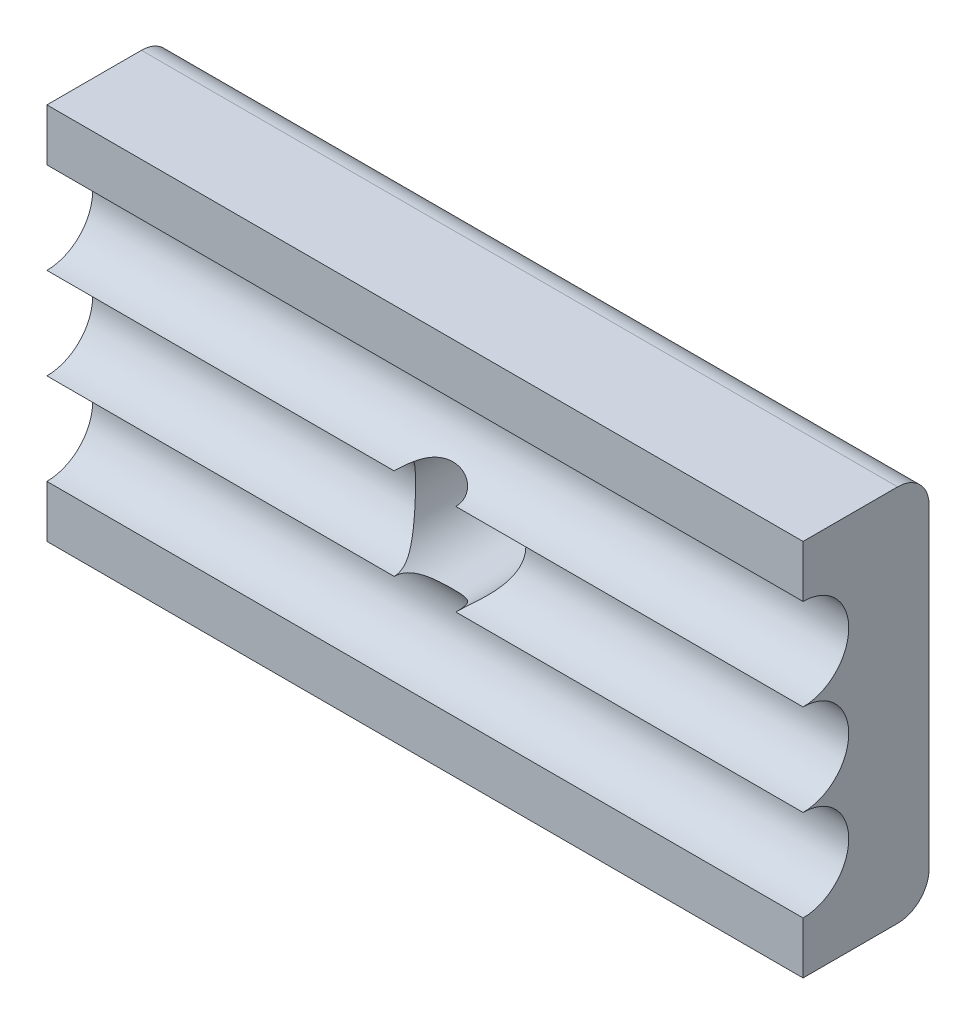
ISO-10303-21;
HEADER;
FILE_DESCRIPTION(('STEP AP214'),'2;1');
FILE_NAME('part.step','',(''),(''),'','','');
FILE_SCHEMA(('AUTOMOTIVE_DESIGN { 1 0 10303 214 1 1 1 1 }'));
ENDSEC;
DATA;
#1=APPLICATION_CONTEXT('core data for automotive mechanical design processes');
#2=APPLICATION_PROTOCOL_DEFINITION('international standard','automotive_design',2000,#1);
#3=PRODUCT_CONTEXT('',#1,'mechanical');
#4=PRODUCT('Part','Part','',(#3));
#5=PRODUCT_RELATED_PRODUCT_CATEGORY('part','',(#4));
#6=PRODUCT_DEFINITION_FORMATION('','',#4);
#7=PRODUCT_DEFINITION_CONTEXT('part definition',#1,'design');
#8=PRODUCT_DEFINITION('design','',#6,#7);
#9=PRODUCT_DEFINITION_SHAPE('','',#8);
#10=(LENGTH_UNIT() NAMED_UNIT(*) SI_UNIT(.MILLI.,.METRE.));
#11=(NAMED_UNIT(*) PLANE_ANGLE_UNIT() SI_UNIT($,.RADIAN.));
#12=(NAMED_UNIT(*) SI_UNIT($,.STERADIAN.) SOLID_ANGLE_UNIT());
#13=UNCERTAINTY_MEASURE_WITH_UNIT(LENGTH_MEASURE(1.E-05),#10,'distance_accuracy_value','');
#14=(GEOMETRIC_REPRESENTATION_CONTEXT(3) GLOBAL_UNCERTAINTY_ASSIGNED_CONTEXT((#13)) GLOBAL_UNIT_ASSIGNED_CONTEXT((#10,
#11,#12)) REPRESENTATION_CONTEXT('',''));
#15=CARTESIAN_POINT('',(0.,0.,0.));
#16=DIRECTION('',(0.,0.,1.));
#17=DIRECTION('',(1.,0.,0.));
#18=AXIS2_PLACEMENT_3D('',#15,#16,#17);
#19=CARTESIAN_POINT('',(0.,0.,4.));
#20=DIRECTION('',(0.,0.,1.));
#21=DIRECTION('',(1.,0.,0.));
#22=AXIS2_PLACEMENT_3D('',#19,#20,#21);
#23=PLANE('',#22);
#24=DIRECTION('',(-1.,0.,0.));
#25=VECTOR('',#24,1.);
#26=CARTESIAN_POINT('',(26.957345971564,2.35,4.));
#27=LINE('',#26,#25);
#28=CARTESIAN_POINT('',(18.957345971564,2.35,4.));
#29=VERTEX_POINT('',#28);
#30=CARTESIAN_POINT('',(-5.04265402843602,2.35,4.));
#31=VERTEX_POINT('',#30);
#32=EDGE_CURVE('E152',#29,#31,#27,.T.);
#33=ORIENTED_EDGE('',*,*,#32,.F.);
#34=DIRECTION('',(0.,1.,0.));
#35=VECTOR('',#34,1.);
#36=CARTESIAN_POINT('',(18.957345971564,4.,4.));
#37=LINE('',#36,#35);
#38=CARTESIAN_POINT('',(18.957345971564,4.,4.));
#39=VERTEX_POINT('',#38);
#40=EDGE_CURVE('E188',#29,#39,#37,.T.);
#41=ORIENTED_EDGE('',*,*,#40,.T.);
#42=DIRECTION('',(-1.,0.,0.));
#43=VECTOR('',#42,1.);
#44=CARTESIAN_POINT('',(-5.04265402843602,4.,4.));
#45=LINE('',#44,#43);
#46=CARTESIAN_POINT('',(-5.04265402843602,4.,4.));
#47=VERTEX_POINT('',#46);
#48=EDGE_CURVE('E192',#39,#47,#45,.T.);
#49=ORIENTED_EDGE('',*,*,#48,.T.);
#50=DIRECTION('',(0.,-1.,0.));
#51=VECTOR('',#50,1.);
#52=CARTESIAN_POINT('',(-5.04265402843602,4.,4.));
#53=LINE('',#52,#51);
#54=EDGE_CURVE('E183',#47,#31,#53,.T.);
#55=ORIENTED_EDGE('',*,*,#54,.T.);
#56=EDGE_LOOP('',(#33,#41,#49,#55));
#57=FACE_BOUND('',#56,.T.);
#58=ADVANCED_FACE('F45',(#57),#23,.T.);
#59=CARTESIAN_POINT('',(-5.04265402843602,4.,4.));
#60=DIRECTION('',(1.,0.,0.));
#61=DIRECTION('',(0.,1.,0.));
#62=AXIS2_PLACEMENT_3D('',#59,#60,#61);
#63=PLANE('',#62);
#64=CARTESIAN_POINT('',(-5.04265402843602,-4.9,4.));
#65=DIRECTION('',(-1.,0.,0.));
#66=DIRECTION('',(0.,0.,1.));
#67=AXIS2_PLACEMENT_3D('',#64,#65,#66);
#68=CIRCLE('',#67,1.45);
#69=CARTESIAN_POINT('',(-5.04265402843602,-3.45,4.));
#70=VERTEX_POINT('',#69);
#71=CARTESIAN_POINT('',(-5.04265402843602,-6.35,4.));
#72=VERTEX_POINT('',#71);
#73=EDGE_CURVE('E162',#70,#72,#68,.T.);
#74=ORIENTED_EDGE('',*,*,#73,.F.);
#75=CARTESIAN_POINT('',(-5.04265402843602,-2.,4.));
#76=DIRECTION('',(-1.,0.,0.));
#77=DIRECTION('',(0.,0.,1.));
#78=AXIS2_PLACEMENT_3D('',#75,#76,#77);
#79=CIRCLE('',#78,1.45);
#80=CARTESIAN_POINT('',(-5.04265402843602,-0.55,4.));
#81=VERTEX_POINT('',#80);
#82=EDGE_CURVE('E143',#81,#70,#79,.T.);
#83=ORIENTED_EDGE('',*,*,#82,.F.);
#84=CARTESIAN_POINT('',(-5.04265402843602,0.9,4.));
#85=DIRECTION('',(-1.,0.,0.));
#86=DIRECTION('',(0.,0.,1.));
#87=AXIS2_PLACEMENT_3D('',#84,#85,#86);
#88=CIRCLE('',#87,1.45);
#89=EDGE_CURVE('E159',#31,#81,#88,.T.);
#90=ORIENTED_EDGE('',*,*,#89,.F.);
#91=ORIENTED_EDGE('',*,*,#54,.F.);
#92=DIRECTION('',(0.,0.,-1.));
#93=VECTOR('',#92,1.);
#94=CARTESIAN_POINT('',(-5.04265402843602,4.,4.));
#95=LINE('',#94,#93);
#96=CARTESIAN_POINT('',(-5.04265402843602,4.,1.));
#97=VERTEX_POINT('',#96);
#98=EDGE_CURVE('E194',#47,#97,#95,.T.);
#99=ORIENTED_EDGE('',*,*,#98,.T.);
#100=CARTESIAN_POINT('',(-5.04265402843602,3.,1.));
#101=DIRECTION('',(1.,0.,0.));
#102=DIRECTION('',(0.,1.,0.));
#103=AXIS2_PLACEMENT_3D('',#100,#101,#102);
#104=CIRCLE('',#103,1.);
#105=CARTESIAN_POINT('',(-5.04265402843602,3.,0.));
#106=VERTEX_POINT('',#105);
#107=EDGE_CURVE('E74',#97,#106,#104,.F.);
#108=ORIENTED_EDGE('',*,*,#107,.T.);
#109=DIRECTION('',(0.,-1.,0.));
#110=VECTOR('',#109,1.);
#111=CARTESIAN_POINT('',(-5.04265402843602,4.,0.));
#112=LINE('',#111,#110);
#113=CARTESIAN_POINT('',(-5.04265402843602,-7.,0.));
#114=VERTEX_POINT('',#113);
#115=EDGE_CURVE('E195',#106,#114,#112,.T.);
#116=ORIENTED_EDGE('',*,*,#115,.T.);
#117=CARTESIAN_POINT('',(-5.04265402843602,-7.,1.));
#118=DIRECTION('',(1.,0.,0.));
#119=DIRECTION('',(0.,1.,0.));
#120=AXIS2_PLACEMENT_3D('',#117,#118,#119);
#121=CIRCLE('',#120,1.);
#122=CARTESIAN_POINT('',(-5.04265402843602,-8.,1.));
#123=VERTEX_POINT('',#122);
#124=EDGE_CURVE('E226',#114,#123,#121,.F.);
#125=ORIENTED_EDGE('',*,*,#124,.T.);
#126=DIRECTION('',(0.,0.,-1.));
#127=VECTOR('',#126,1.);
#128=CARTESIAN_POINT('',(-5.04265402843602,-8.,4.));
#129=LINE('',#128,#127);
#130=CARTESIAN_POINT('',(-5.04265402843602,-8.,4.));
#131=VERTEX_POINT('',#130);
#132=EDGE_CURVE('E209',#131,#123,#129,.T.);
#133=ORIENTED_EDGE('',*,*,#132,.F.);
#134=EDGE_CURVE('E186',#72,#131,#53,.T.);
#135=ORIENTED_EDGE('',*,*,#134,.F.);
#136=EDGE_LOOP('',(#74,#83,#90,#91,#99,#108,#116,#125,#133,#135));
#137=FACE_BOUND('',#136,.T.);
#138=ADVANCED_FACE('F157',(#137),#63,.F.);
#139=CARTESIAN_POINT('',(-5.04265402843602,-8.,4.));
#140=DIRECTION('',(0.,1.,0.));
#141=DIRECTION('',(0.,0.,1.));
#142=AXIS2_PLACEMENT_3D('',#139,#140,#141);
#143=PLANE('',#142);
#144=ORIENTED_EDGE('',*,*,#132,.T.);
#145=DIRECTION('',(1.,0.,0.));
#146=VECTOR('',#145,1.);
#147=CARTESIAN_POINT('',(-5.04265402843602,-8.,1.));
#148=LINE('',#147,#146);
#149=CARTESIAN_POINT('',(18.957345971564,-8.,1.));
#150=VERTEX_POINT('',#149);
#151=EDGE_CURVE('E212',#123,#150,#148,.T.);
#152=ORIENTED_EDGE('',*,*,#151,.T.);
#153=DIRECTION('',(0.,0.,-1.));
#154=VECTOR('',#153,1.);
#155=CARTESIAN_POINT('',(18.957345971564,-8.,4.));
#156=LINE('',#155,#154);
#157=CARTESIAN_POINT('',(18.957345971564,-8.,4.));
#158=VERTEX_POINT('',#157);
#159=EDGE_CURVE('E206',#158,#150,#156,.T.);
#160=ORIENTED_EDGE('',*,*,#159,.F.);
#161=DIRECTION('',(1.,0.,0.));
#162=VECTOR('',#161,1.);
#163=CARTESIAN_POINT('',(-5.04265402843602,-8.,4.));
#164=LINE('',#163,#162);
#165=EDGE_CURVE('E185',#131,#158,#164,.T.);
#166=ORIENTED_EDGE('',*,*,#165,.F.);
#167=EDGE_LOOP('',(#144,#152,#160,#166));
#168=FACE_BOUND('',#167,.T.);
#169=ADVANCED_FACE('F289',(#168),#143,.F.);
#170=CARTESIAN_POINT('',(18.957345971564,4.,4.));
#171=DIRECTION('',(-1.,0.,0.));
#172=DIRECTION('',(0.,0.,1.));
#173=AXIS2_PLACEMENT_3D('',#170,#171,#172);
#174=PLANE('',#173);
#175=CARTESIAN_POINT('',(18.957345971564,0.9,4.));
#176=DIRECTION('',(-1.,0.,0.));
#177=DIRECTION('',(0.,0.,1.));
#178=AXIS2_PLACEMENT_3D('',#175,#176,#177);
#179=CIRCLE('',#178,1.45);
#180=CARTESIAN_POINT('',(18.957345971564,-0.55,4.));
#181=VERTEX_POINT('',#180);
#182=EDGE_CURVE('E175',#29,#181,#179,.T.);
#183=ORIENTED_EDGE('',*,*,#182,.T.);
#184=CARTESIAN_POINT('',(18.957345971564,-2.,4.));
#185=DIRECTION('',(-1.,0.,0.));
#186=DIRECTION('',(0.,0.,1.));
#187=AXIS2_PLACEMENT_3D('',#184,#185,#186);
#188=CIRCLE('',#187,1.45);
#189=CARTESIAN_POINT('',(18.957345971564,-3.45,4.));
#190=VERTEX_POINT('',#189);
#191=EDGE_CURVE('E166',#181,#190,#188,.T.);
#192=ORIENTED_EDGE('',*,*,#191,.T.);
#193=CARTESIAN_POINT('',(18.957345971564,-4.9,4.));
#194=DIRECTION('',(-1.,0.,0.));
#195=DIRECTION('',(0.,0.,1.));
#196=AXIS2_PLACEMENT_3D('',#193,#194,#195);
#197=CIRCLE('',#196,1.45);
#198=CARTESIAN_POINT('',(18.957345971564,-6.35,4.));
#199=VERTEX_POINT('',#198);
#200=EDGE_CURVE('E178',#190,#199,#197,.T.);
#201=ORIENTED_EDGE('',*,*,#200,.T.);
#202=EDGE_CURVE('E189',#158,#199,#37,.T.);
#203=ORIENTED_EDGE('',*,*,#202,.F.);
#204=ORIENTED_EDGE('',*,*,#159,.T.);
#205=CARTESIAN_POINT('',(18.957345971564,-7.,1.));
#206=DIRECTION('',(-1.,0.,0.));
#207=DIRECTION('',(0.,0.,1.));
#208=AXIS2_PLACEMENT_3D('',#205,#206,#207);
#209=CIRCLE('',#208,1.);
#210=CARTESIAN_POINT('',(18.957345971564,-7.,0.));
#211=VERTEX_POINT('',#210);
#212=EDGE_CURVE('E219',#150,#211,#209,.F.);
#213=ORIENTED_EDGE('',*,*,#212,.T.);
#214=DIRECTION('',(0.,1.,0.));
#215=VECTOR('',#214,1.);
#216=CARTESIAN_POINT('',(18.957345971564,4.,0.));
#217=LINE('',#216,#215);
#218=CARTESIAN_POINT('',(18.957345971564,3.,0.));
#219=VERTEX_POINT('',#218);
#220=EDGE_CURVE('E198',#211,#219,#217,.T.);
#221=ORIENTED_EDGE('',*,*,#220,.T.);
#222=CARTESIAN_POINT('',(18.957345971564,3.,1.));
#223=DIRECTION('',(-1.,0.,0.));
#224=DIRECTION('',(0.,0.,1.));
#225=AXIS2_PLACEMENT_3D('',#222,#223,#224);
#226=CIRCLE('',#225,1.);
#227=CARTESIAN_POINT('',(18.957345971564,4.,1.));
#228=VERTEX_POINT('',#227);
#229=EDGE_CURVE('E217',#219,#228,#226,.F.);
#230=ORIENTED_EDGE('',*,*,#229,.T.);
#231=DIRECTION('',(0.,0.,-1.));
#232=VECTOR('',#231,1.);
#233=CARTESIAN_POINT('',(18.957345971564,4.,4.));
#234=LINE('',#233,#232);
#235=EDGE_CURVE('E203',#39,#228,#234,.T.);
#236=ORIENTED_EDGE('',*,*,#235,.F.);
#237=ORIENTED_EDGE('',*,*,#40,.F.);
#238=EDGE_LOOP('',(#183,#192,#201,#203,#204,#213,#221,#230,#236,#237));
#239=FACE_BOUND('',#238,.T.);
#240=ADVANCED_FACE('F269',(#239),#174,.F.);
#241=CARTESIAN_POINT('',(-5.04265402843602,4.,4.));
#242=DIRECTION('',(0.,-1.,0.));
#243=DIRECTION('',(0.,0.,-1.));
#244=AXIS2_PLACEMENT_3D('',#241,#242,#243);
#245=PLANE('',#244);
#246=ORIENTED_EDGE('',*,*,#235,.T.);
#247=DIRECTION('',(-1.,0.,0.));
#248=VECTOR('',#247,1.);
#249=CARTESIAN_POINT('',(-5.04265402843602,4.,1.));
#250=LINE('',#249,#248);
#251=EDGE_CURVE('E228',#228,#97,#250,.T.);
#252=ORIENTED_EDGE('',*,*,#251,.T.);
#253=ORIENTED_EDGE('',*,*,#98,.F.);
#254=ORIENTED_EDGE('',*,*,#48,.F.);
#255=EDGE_LOOP('',(#246,#252,#253,#254));
#256=FACE_BOUND('',#255,.T.);
#257=ADVANCED_FACE('F276',(#256),#245,.F.);
#258=DIRECTION('',(-1.,0.,0.));
#259=VECTOR('',#258,1.);
#260=CARTESIAN_POINT('',(26.957345971564,-6.35,4.));
#261=LINE('',#260,#259);
#262=EDGE_CURVE('E179',#199,#72,#261,.T.);
#263=ORIENTED_EDGE('',*,*,#262,.T.);
#264=ORIENTED_EDGE('',*,*,#134,.T.);
#265=ORIENTED_EDGE('',*,*,#165,.T.);
#266=ORIENTED_EDGE('',*,*,#202,.T.);
#267=EDGE_LOOP('',(#263,#264,#265,#266));
#268=FACE_BOUND('',#267,.T.);
#269=ADVANCED_FACE('F292',(#268),#23,.T.);
#270=CARTESIAN_POINT('',(0.,0.,0.));
#271=DIRECTION('',(0.,0.,1.));
#272=DIRECTION('',(1.,0.,0.));
#273=AXIS2_PLACEMENT_3D('',#270,#271,#272);
#274=PLANE('',#273);
#275=CARTESIAN_POINT('',(6.95734597156398,-2.,0.));
#276=DIRECTION('',(0.,0.,1.));
#277=DIRECTION('',(1.,0.,0.));
#278=AXIS2_PLACEMENT_3D('',#275,#276,#277);
#279=CIRCLE('',#278,1.75);
#280=CARTESIAN_POINT('',(8.70734597156398,-2.,0.));
#281=VERTEX_POINT('',#280);
#282=EDGE_CURVE('E182',#281,#281,#279,.T.);
#283=ORIENTED_EDGE('',*,*,#282,.T.);
#284=EDGE_LOOP('',(#283));
#285=FACE_BOUND('',#284,.T.);
#286=ORIENTED_EDGE('',*,*,#220,.F.);
#287=DIRECTION('',(1.,0.,0.));
#288=VECTOR('',#287,1.);
#289=CARTESIAN_POINT('',(0.,-7.,0.));
#290=LINE('',#289,#288);
#291=EDGE_CURVE('E223',#211,#114,#290,.F.);
#292=ORIENTED_EDGE('',*,*,#291,.T.);
#293=ORIENTED_EDGE('',*,*,#115,.F.);
#294=DIRECTION('',(-1.,0.,0.));
#295=VECTOR('',#294,1.);
#296=CARTESIAN_POINT('',(0.,3.,0.));
#297=LINE('',#296,#295);
#298=EDGE_CURVE('E221',#106,#219,#297,.F.);
#299=ORIENTED_EDGE('',*,*,#298,.T.);
#300=EDGE_LOOP('',(#286,#292,#293,#299));
#301=FACE_BOUND('',#300,.T.);
#302=ADVANCED_FACE('F281',(#285,#301),#274,.F.);
#303=CARTESIAN_POINT('',(6.95734597156398,-2.,-1.));
#304=DIRECTION('',(0.,0.,1.));
#305=DIRECTION('',(1.,0.,0.));
#306=AXIS2_PLACEMENT_3D('',#303,#304,#305);
#307=CYLINDRICAL_SURFACE('',#306,1.75);
#308=CARTESIAN_POINT('',(5.97755007445071,-3.45,4.));
#309=CARTESIAN_POINT('',(5.97755194233283,-3.4499976677626,3.97633628601516));
#310=CARTESIAN_POINT('',(5.97840779616265,-3.45057997572129,3.95268466196154));
#311=CARTESIAN_POINT('',(5.98183220967503,-3.45288650876825,3.90556346460477));
#312=CARTESIAN_POINT('',(5.9844006503065,-3.45461065448121,3.88209387876188));
#313=CARTESIAN_POINT('',(5.99466429959437,-3.46144306360112,3.81231123516577));
#314=CARTESIAN_POINT('',(6.00491781873658,-3.46821158619935,3.76649956243252));
#315=CARTESIAN_POINT('',(6.03219586271997,-3.48554870649781,3.67769513381392));
#316=CARTESIAN_POINT('',(6.0492247376288,-3.49611974515662,3.63470420966722));
#317=CARTESIAN_POINT('',(6.08983583666907,-3.52002568309783,3.55279734500478));
#318=CARTESIAN_POINT('',(6.11341563001302,-3.53335955673556,3.5138799003417));
#319=CARTESIAN_POINT('',(6.1660822015259,-3.56117446275479,3.4418718611224));
#320=CARTESIAN_POINT('',(6.19503805784331,-3.57562423926489,3.40867294915179));
#321=CARTESIAN_POINT('',(6.2580934112533,-3.60460232196287,3.34762807762235));
#322=CARTESIAN_POINT('',(6.29219458348109,-3.61913065223443,3.31978386810744));
#323=CARTESIAN_POINT('',(6.36662290101983,-3.64779197463727,3.26829484259211));
#324=CARTESIAN_POINT('',(6.40718673302541,-3.66186131321143,3.24495776993625));
#325=CARTESIAN_POINT('',(6.49194694241746,-3.68756272790673,3.20433997789725));
#326=CARTESIAN_POINT('',(6.53614472662384,-3.69919385387318,3.18706161779475));
#327=CARTESIAN_POINT('',(6.63158574601928,-3.72017293560857,3.15686197808194));
#328=CARTESIAN_POINT('',(6.6830934435594,-3.72918125200536,3.14454073124165));
#329=CARTESIAN_POINT('',(6.78784347414491,-3.74257356116374,3.12650746232511));
#330=CARTESIAN_POINT('',(6.84108670146586,-3.7469551297694,3.12079890477481));
#331=CARTESIAN_POINT('',(6.95289364090652,-3.75096588019993,3.11555914363058));
#332=CARTESIAN_POINT('',(7.01150366001797,-3.75013021609981,3.11663227418696));
#333=CARTESIAN_POINT('',(7.12772435070585,-3.74266000882637,3.12644340857658));
#334=CARTESIAN_POINT('',(7.1853347164129,-3.73602372163551,3.13518371762943));
#335=CARTESIAN_POINT('',(7.29894486835073,-3.71731826910091,3.16093943847082));
#336=CARTESIAN_POINT('',(7.35489471271013,-3.70515027323467,3.17810585815966));
#337=CARTESIAN_POINT('',(7.46208520597385,-3.67654699508107,3.22132801950014));
#338=CARTESIAN_POINT('',(7.51332857643663,-3.66011420025312,3.2473785822155));
#339=CARTESIAN_POINT('',(7.60561878852903,-3.62618791749578,3.30647814086269));
#340=CARTESIAN_POINT('',(7.64713506789811,-3.6088571310306,3.33888461801672));
#341=CARTESIAN_POINT('',(7.72283575354644,-3.57424880202857,3.41136922314374));
#342=CARTESIAN_POINT('',(7.75702732923928,-3.55697122389341,3.45143977611704));
#343=CARTESIAN_POINT('',(7.81370724432938,-3.5264578080733,3.53353928284657));
#344=CARTESIAN_POINT('',(7.83706265046234,-3.51298685276081,3.57488458289477));
#345=CARTESIAN_POINT('',(7.87661083942584,-3.48928984904281,3.66173848049971));
#346=CARTESIAN_POINT('',(7.89280463760474,-3.47906334070882,3.70724648677735));
#347=CARTESIAN_POINT('',(7.91591548235988,-3.4641762550955,3.79377994523416));
#348=CARTESIAN_POINT('',(7.92387200353293,-3.4589039269173,3.83442764997567));
#349=CARTESIAN_POINT('',(7.93448629090479,-3.45179377332595,3.91671047383407));
#350=CARTESIAN_POINT('',(7.93714302893682,-3.44995661434569,3.95834578296282));
#351=CARTESIAN_POINT('',(7.93714186867727,-3.45,3.99999999999999));
#352=B_SPLINE_CURVE_WITH_KNOTS('',3,(#308,#309,#310,#311,#312,#313,#314,#315,#316,#317,#318,
#319,#320,#321,#322,#323,#324,#325,#326,#327,#328,#329,#330,#331,#332,#333,#334,#335,#336,#337,
#338,#339,#340,#341,#342,#343,#344,#345,#346,#347,#348,#349,#350,#351),.UNSPECIFIED.,.F.,.F.,(4,
2,2,2,2,2,2,2,2,2,2,2,2,2,2,2,2,2,2,2,2,4),(0.,0.0709445106135215,0.141884090007934,
0.283394167009063,0.424995246512599,0.566543853455673,0.705013990204751,0.843529305657935,
0.989520264844489,1.13556801037601,1.29606202387151,1.45664008555401,1.63171770008956,
1.80684797164021,1.98523819492668,2.16352460438936,2.328914974554,2.49414271353915,
2.64145182630179,2.78874004738017,2.91352000216208,3.03832416210995),.UNSPECIFIED.);
#353=CARTESIAN_POINT('',(5.97755007445071,-3.45,4.));
#354=VERTEX_POINT('',#353);
#355=CARTESIAN_POINT('',(7.93714186867725,-3.45,4.));
#356=VERTEX_POINT('',#355);
#357=EDGE_CURVE('E12',#354,#356,#352,.T.);
#358=ORIENTED_EDGE('',*,*,#357,.T.);
#359=CARTESIAN_POINT('',(7.93714186867725,-3.45,4.));
#360=CARTESIAN_POINT('',(7.93712694195492,-3.45000457422705,3.97384849977603));
#361=CARTESIAN_POINT('',(7.93818984872994,-3.44929222429545,3.94771467125591));
#362=CARTESIAN_POINT('',(7.94233757049675,-3.44647897993039,3.89573135695612));
#363=CARTESIAN_POINT('',(7.94541856181722,-3.44438071133856,3.86988142726166));
#364=CARTESIAN_POINT('',(7.95737435292124,-3.43615370707763,3.79375040887032));
#365=CARTESIAN_POINT('',(7.96897024386519,-3.42808967889254,3.74409305841648));
#366=CARTESIAN_POINT('',(8.00320123908842,-3.4033086978184,3.62855739178309));
#367=CARTESIAN_POINT('',(8.02838037676746,-3.38444070148726,3.56393400281107));
#368=CARTESIAN_POINT('',(8.08465523469828,-3.33902864862552,3.4397150939739));
#369=CARTESIAN_POINT('',(8.11579856258607,-3.31242186645739,3.38016601777156));
#370=CARTESIAN_POINT('',(8.19448500847448,-3.23934082224885,3.24169012741478));
#371=CARTESIAN_POINT('',(8.24333109447636,-3.18924040640139,3.16541247821936));
#372=CARTESIAN_POINT('',(8.3398836522418,-3.07548605748851,3.0232305228156));
#373=CARTESIAN_POINT('',(8.38759234247678,-3.01186140859376,2.9573043303406));
#374=CARTESIAN_POINT('',(8.46803578988114,-2.8858208742516,2.84971077641952));
#375=CARTESIAN_POINT('',(8.50181308877479,-2.82594704764604,2.80585507684761));
#376=CARTESIAN_POINT('',(8.56366589925842,-2.69804148691774,2.72686727468147));
#377=CARTESIAN_POINT('',(8.59174936618408,-2.63002134918538,2.69172298513018));
#378=CARTESIAN_POINT('',(8.6358243094424,-2.49912924515866,2.63709834010694));
#379=CARTESIAN_POINT('',(8.65306307974629,-2.43737142162135,2.61596600335409));
#380=CARTESIAN_POINT('',(8.680869179829,-2.31015494598389,2.58203393584242));
#381=CARTESIAN_POINT('',(8.69144051328596,-2.24469854059818,2.56922920435944));
#382=CARTESIAN_POINT('',(8.70507067138222,-2.11158059104052,2.55273930984938));
#383=CARTESIAN_POINT('',(8.7080987021817,-2.04391114681158,2.54909152754864));
#384=CARTESIAN_POINT('',(8.7062742489475,-1.90883589207286,2.55129347080933));
#385=CARTESIAN_POINT('',(8.70142203420975,-1.84143007263301,2.55714287181834));
#386=CARTESIAN_POINT('',(8.68484326626472,-1.71337748181986,2.57722947355189));
#387=CARTESIAN_POINT('',(8.67358613029054,-1.65257672355844,2.59089421256889));
#388=CARTESIAN_POINT('',(8.64537889855949,-1.53445048483836,2.62538970240973));
#389=CARTESIAN_POINT('',(8.62842724725817,-1.47712595902262,2.64622241131255));
#390=CARTESIAN_POINT('',(8.58815804007369,-1.36204385659809,2.6962408805728));
#391=CARTESIAN_POINT('',(8.56441333950154,-1.30468703651003,2.72599791358064));
#392=CARTESIAN_POINT('',(8.51277486326734,-1.19577389686584,2.79178884168476));
#393=CARTESIAN_POINT('',(8.48487945333408,-1.14421987617043,2.82782521012295));
#394=CARTESIAN_POINT('',(8.42018982628535,-1.03704957350925,2.91332843620849));
#395=CARTESIAN_POINT('',(8.38275037920122,-0.982811393993582,2.96403041505188));
#396=CARTESIAN_POINT('',(8.30605939521335,-0.883114974796169,3.07236836026789));
#397=CARTESIAN_POINT('',(8.26680501805877,-0.837671116434414,3.13001543833536));
#398=CARTESIAN_POINT('',(8.18920789593186,-0.755736327943038,3.25186458357728));
#399=CARTESIAN_POINT('',(8.15086479151103,-0.719241813009706,3.3160640114604));
#400=CARTESIAN_POINT('',(8.07879756575669,-0.655703510063282,3.45142310760666));
#401=CARTESIAN_POINT('',(8.04506430373272,-0.628640849681913,3.52256850791145));
#402=CARTESIAN_POINT('',(7.99854112837019,-0.593251458527627,3.64501345530275));
#403=CARTESIAN_POINT('',(7.9825925100878,-0.58168928160716,3.69415368485867));
#404=CARTESIAN_POINT('',(7.95720552211683,-0.563674967785596,3.79491097437534));
#405=CARTESIAN_POINT('',(7.94773987906073,-0.557201406271136,3.84651666883369));
#406=CARTESIAN_POINT('',(7.94063656348725,-0.552366696999186,3.91547572712931));
#407=CARTESIAN_POINT('',(7.93933080465079,-0.551481173635354,3.93232727036138));
#408=CARTESIAN_POINT('',(7.93758274062514,-0.550297581472871,3.96611676632377));
#409=CARTESIAN_POINT('',(7.93714152221471,-0.550000252064517,3.98305480101173));
#410=CARTESIAN_POINT('',(7.93714186867725,-0.55,4.));
#411=B_SPLINE_CURVE_WITH_KNOTS('',3,(#359,#360,#361,#362,#363,#364,#365,#366,#367,#368,#369,
#370,#371,#372,#373,#374,#375,#376,#377,#378,#379,#380,#381,#382,#383,#384,#385,#386,#387,#388,
#389,#390,#391,#392,#393,#394,#395,#396,#397,#398,#399,#400,#401,#402,#403,#404,#405,#406,#407,
#408,#409,#410),.UNSPECIFIED.,.F.,.F.,(4,2,2,2,2,2,2,2,2,2,2,2,2,2,2,2,2,2,2,2,2,2,2,2,2,4),(0.,
0.0783924037094114,0.156636705056378,0.310777259551677,0.525225330081146,0.741462470550051,
1.05048404321804,1.35884318290749,1.6025672508554,1.8459484082501,2.04763753302633,
2.24920543144687,2.45159484698619,2.65397734630737,2.84314877946327,3.03237192978362,
3.23814732582164,3.44400395786972,3.69259126394255,3.94158171098837,4.19047225738098,
4.43886189579678,4.59717516506756,4.75481826305044,4.80556791861546,4.85638132869327),.UNSPECIFIED.);
#412=CARTESIAN_POINT('',(7.93714186867725,-0.55,4.));
#413=VERTEX_POINT('',#412);
#414=EDGE_CURVE('E66',#356,#413,#411,.T.);
#415=ORIENTED_EDGE('',*,*,#414,.T.);
#416=CARTESIAN_POINT('',(7.93714186867725,-0.55,4.));
#417=CARTESIAN_POINT('',(7.93714000079514,-0.550002332237396,3.97633628601516));
#418=CARTESIAN_POINT('',(7.93628414696532,-0.549420024278711,3.95268466196154));
#419=CARTESIAN_POINT('',(7.93285973345294,-0.547113491231749,3.90556346460477));
#420=CARTESIAN_POINT('',(7.93029129282147,-0.545389345518791,3.88209387876188));
#421=CARTESIAN_POINT('',(7.92002764353359,-0.538556936398879,3.81231123516577));
#422=CARTESIAN_POINT('',(7.90977412439139,-0.531788413800647,3.76649956243252));
#423=CARTESIAN_POINT('',(7.88249608040799,-0.514451293502187,3.67769513381392));
#424=CARTESIAN_POINT('',(7.86546720549916,-0.503880254843383,3.63470420966722));
#425=CARTESIAN_POINT('',(7.82485610645889,-0.479974316902173,3.55279734500478));
#426=CARTESIAN_POINT('',(7.80127631311494,-0.466640443264439,3.5138799003417));
#427=CARTESIAN_POINT('',(7.74860974160207,-0.438825537245214,3.4418718611224));
#428=CARTESIAN_POINT('',(7.71965388528465,-0.424375760735108,3.40867294915179));
#429=CARTESIAN_POINT('',(7.65659853187466,-0.395397678037135,3.34762807762235));
#430=CARTESIAN_POINT('',(7.62249735964688,-0.380869347765572,3.31978386810744));
#431=CARTESIAN_POINT('',(7.54806904210814,-0.352208025362731,3.26829484259211));
#432=CARTESIAN_POINT('',(7.50750521010255,-0.338138686788571,3.24495776993625));
#433=CARTESIAN_POINT('',(7.42274500071051,-0.312437272093275,3.20433997789725));
#434=CARTESIAN_POINT('',(7.37854721650412,-0.300806146126824,3.18706161779475));
#435=CARTESIAN_POINT('',(7.28310619710869,-0.279827064391435,3.15686197808194));
#436=CARTESIAN_POINT('',(7.23159849956857,-0.270818747994643,3.14454073124165));
#437=CARTESIAN_POINT('',(7.12684846898306,-0.257426438836257,3.12650746232511));
#438=CARTESIAN_POINT('',(7.07360524166211,-0.253044870230603,3.12079890477481));
#439=CARTESIAN_POINT('',(6.96179830222145,-0.249034119800074,3.11555914363058));
#440=CARTESIAN_POINT('',(6.90318828311,-0.249869783900187,3.11663227418696));
#441=CARTESIAN_POINT('',(6.78696759242211,-0.25733999117363,3.12644340857658));
#442=CARTESIAN_POINT('',(6.72935722671507,-0.263976278364487,3.13518371762943));
#443=CARTESIAN_POINT('',(6.61574707477723,-0.282681730899089,3.16093943847082));
#444=CARTESIAN_POINT('',(6.55979723041783,-0.294849726765329,3.17810585815966));
#445=CARTESIAN_POINT('',(6.45260673715411,-0.323453004918931,3.22132801950014));
#446=CARTESIAN_POINT('',(6.40136336669134,-0.339885799746876,3.2473785822155));
#447=CARTESIAN_POINT('',(6.30907315459893,-0.373812082504221,3.30647814086269));
#448=CARTESIAN_POINT('',(6.26755687522985,-0.391142868969399,3.33888461801672));
#449=CARTESIAN_POINT('',(6.19185618958152,-0.425751197971429,3.41136922314374));
#450=CARTESIAN_POINT('',(6.15766461388868,-0.443028776106592,3.45143977611704));
#451=CARTESIAN_POINT('',(6.10098469879858,-0.473542191926698,3.53353928284657));
#452=CARTESIAN_POINT('',(6.07762929266563,-0.487013147239193,3.57488458289477));
#453=CARTESIAN_POINT('',(6.03808110370212,-0.510710150957189,3.66173848049971));
#454=CARTESIAN_POINT('',(6.02188730552322,-0.520936659291178,3.70724648677735));
#455=CARTESIAN_POINT('',(5.99877646076809,-0.535823744904498,3.79377994523416));
#456=CARTESIAN_POINT('',(5.99081993959503,-0.541096073082699,3.83442764997567));
#457=CARTESIAN_POINT('',(5.98020565222318,-0.548206226674046,3.91671047383407));
#458=CARTESIAN_POINT('',(5.97754891419114,-0.550043385654307,3.95834578296282));
#459=CARTESIAN_POINT('',(5.97755007445069,-0.550000000000001,3.99999999999999));
#460=B_SPLINE_CURVE_WITH_KNOTS('',3,(#416,#417,#418,#419,#420,#421,#422,#423,#424,#425,#426,
#427,#428,#429,#430,#431,#432,#433,#434,#435,#436,#437,#438,#439,#440,#441,#442,#443,#444,#445,
#446,#447,#448,#449,#450,#451,#452,#453,#454,#455,#456,#457,#458,#459),.UNSPECIFIED.,.F.,.F.,(4,
2,2,2,2,2,2,2,2,2,2,2,2,2,2,2,2,2,2,2,2,4),(0.,0.0709445106135214,0.141884090007935,
0.283394167009063,0.424995246512598,0.566543853455673,0.705013990204751,0.843529305657935,
0.989520264844488,1.13556801037601,1.29606202387151,1.45664008555401,1.63171770008956,
1.80684797164021,1.98523819492668,2.16352460438937,2.328914974554,2.49414271353915,
2.64145182630179,2.78874004738018,2.91352000216208,3.03832416210995),.UNSPECIFIED.);
#461=CARTESIAN_POINT('',(5.97755007445071,-0.55,4.));
#462=VERTEX_POINT('',#461);
#463=EDGE_CURVE('E59',#413,#462,#460,.T.);
#464=ORIENTED_EDGE('',*,*,#463,.T.);
#465=CARTESIAN_POINT('',(5.97755007445071,-0.55,4.));
#466=CARTESIAN_POINT('',(5.97756500117305,-0.549995425772953,3.97384849977603));
#467=CARTESIAN_POINT('',(5.97650209439802,-0.550707775704552,3.94771467125591));
#468=CARTESIAN_POINT('',(5.97235437263121,-0.553521020069614,3.89573135695613));
#469=CARTESIAN_POINT('',(5.96927338131075,-0.55561928866144,3.86988142726166));
#470=CARTESIAN_POINT('',(5.95731759020673,-0.563846292922371,3.79375040887032));
#471=CARTESIAN_POINT('',(5.94572169926277,-0.571910321107456,3.74409305841648));
#472=CARTESIAN_POINT('',(5.91149070403954,-0.596691302181605,3.62855739178309));
#473=CARTESIAN_POINT('',(5.8863115663605,-0.615559298512743,3.56393400281107));
#474=CARTESIAN_POINT('',(5.83003670842969,-0.660971351374485,3.4397150939739));
#475=CARTESIAN_POINT('',(5.79889338054189,-0.687578133542612,3.38016601777156));
#476=CARTESIAN_POINT('',(5.72020693465349,-0.760659177751151,3.24169012741478));
#477=CARTESIAN_POINT('',(5.6713608486516,-0.810759593598608,3.16541247821936));
#478=CARTESIAN_POINT('',(5.57480829088617,-0.92451394251149,3.0232305228156));
#479=CARTESIAN_POINT('',(5.52709960065118,-0.988138591406241,2.9573043303406));
#480=CARTESIAN_POINT('',(5.44665615324682,-1.11417912574841,2.84971077641952));
#481=CARTESIAN_POINT('',(5.41287885435318,-1.17405295235396,2.80585507684761));
#482=CARTESIAN_POINT('',(5.35102604386954,-1.30195851308226,2.72686727468147));
#483=CARTESIAN_POINT('',(5.32294257694388,-1.36997865081463,2.69172298513018));
#484=CARTESIAN_POINT('',(5.27886763368557,-1.50087075484134,2.63709834010694));
#485=CARTESIAN_POINT('',(5.26162886338168,-1.56262857837865,2.61596600335409));
#486=CARTESIAN_POINT('',(5.23382276329896,-1.68984505401611,2.58203393584242));
#487=CARTESIAN_POINT('',(5.223251429842,-1.75530145940182,2.56922920435944));
#488=CARTESIAN_POINT('',(5.20962127174574,-1.88841940895948,2.55273930984938));
#489=CARTESIAN_POINT('',(5.20659324094626,-1.95608885318842,2.54909152754864));
#490=CARTESIAN_POINT('',(5.20841769418046,-2.09116410792714,2.55129347080933));
#491=CARTESIAN_POINT('',(5.21326990891822,-2.15856992736699,2.55714287181834));
#492=CARTESIAN_POINT('',(5.22984867686324,-2.28662251818014,2.57722947355189));
#493=CARTESIAN_POINT('',(5.24110581283742,-2.34742327644156,2.59089421256889));
#494=CARTESIAN_POINT('',(5.26931304456847,-2.46554951516164,2.62538970240973));
#495=CARTESIAN_POINT('',(5.2862646958698,-2.52287404097738,2.64622241131255));
#496=CARTESIAN_POINT('',(5.32653390305427,-2.63795614340191,2.6962408805728));
#497=CARTESIAN_POINT('',(5.35027860362642,-2.69531296348997,2.72599791358064));
#498=CARTESIAN_POINT('',(5.40191707986062,-2.80422610313416,2.79178884168476));
#499=CARTESIAN_POINT('',(5.42981248979389,-2.85578012382957,2.82782521012295));
#500=CARTESIAN_POINT('',(5.49450211684261,-2.96295042649075,2.91332843620849));
#501=CARTESIAN_POINT('',(5.53194156392674,-3.01718860600642,2.96403041505188));
#502=CARTESIAN_POINT('',(5.60863254791461,-3.11688502520383,3.07236836026789));
#503=CARTESIAN_POINT('',(5.64788692506919,-3.16232888356559,3.13001543833536));
#504=CARTESIAN_POINT('',(5.72548404719611,-3.24426367205696,3.25186458357728));
#505=CARTESIAN_POINT('',(5.76382715161694,-3.28075818699029,3.3160640114604));
#506=CARTESIAN_POINT('',(5.83589437737128,-3.34429648993672,3.45142310760666));
#507=CARTESIAN_POINT('',(5.86962763939525,-3.37135915031809,3.52256850791145));
#508=CARTESIAN_POINT('',(5.91615081475778,-3.40674854147237,3.64501345530275));
#509=CARTESIAN_POINT('',(5.93209943304017,-3.41831071839284,3.69415368485867));
#510=CARTESIAN_POINT('',(5.95748642101113,-3.43632503221441,3.79491097437534));
#511=CARTESIAN_POINT('',(5.96695206406724,-3.44279859372886,3.84651666883369));
#512=CARTESIAN_POINT('',(5.97405537964072,-3.44763330300081,3.91547572712931));
#513=CARTESIAN_POINT('',(5.97536113847718,-3.44851882636465,3.93232727036138));
#514=CARTESIAN_POINT('',(5.97710920250282,-3.44970241852713,3.96611676632377));
#515=CARTESIAN_POINT('',(5.97755042091326,-3.44999974793548,3.98305480101173));
#516=CARTESIAN_POINT('',(5.97755007445071,-3.45,4.));
#517=B_SPLINE_CURVE_WITH_KNOTS('',3,(#465,#466,#467,#468,#469,#470,#471,#472,#473,#474,#475,
#476,#477,#478,#479,#480,#481,#482,#483,#484,#485,#486,#487,#488,#489,#490,#491,#492,#493,#494,
#495,#496,#497,#498,#499,#500,#501,#502,#503,#504,#505,#506,#507,#508,#509,#510,#511,#512,#513,
#514,#515,#516),.UNSPECIFIED.,.F.,.F.,(4,2,2,2,2,2,2,2,2,2,2,2,2,2,2,2,2,2,2,2,2,2,2,2,2,4),(0.,
0.0783924037094106,0.156636705056378,0.310777259551678,0.525225330081148,0.741462470550053,
1.05048404321804,1.35884318290749,1.6025672508554,1.8459484082501,2.04763753302633,
2.24920543144687,2.45159484698619,2.65397734630737,2.84314877946327,3.03237192978362,
3.23814732582164,3.44400395786972,3.69259126394255,3.94158171098837,4.19047225738098,
4.43886189579678,4.59717516506756,4.75481826305044,4.80556791861546,4.85638132869327),.UNSPECIFIED.);
#518=EDGE_CURVE('E146',#462,#354,#517,.T.);
#519=ORIENTED_EDGE('',*,*,#518,.T.);
#520=EDGE_LOOP('',(#358,#415,#464,#519));
#521=FACE_BOUND('',#520,.T.);
#522=ORIENTED_EDGE('',*,*,#282,.F.);
#523=EDGE_LOOP('',(#522));
#524=FACE_BOUND('',#523,.T.);
#525=ADVANCED_FACE('F234',(#521,#524),#307,.F.);
#526=CARTESIAN_POINT('',(-5.04265402843602,-7.,1.));
#527=DIRECTION('',(1.,0.,0.));
#528=DIRECTION('',(0.,0.,-1.));
#529=AXIS2_PLACEMENT_3D('',#526,#527,#528);
#530=CYLINDRICAL_SURFACE('',#529,1.);
#531=ORIENTED_EDGE('',*,*,#124,.F.);
#532=ORIENTED_EDGE('',*,*,#291,.F.);
#533=ORIENTED_EDGE('',*,*,#212,.F.);
#534=ORIENTED_EDGE('',*,*,#151,.F.);
#535=EDGE_LOOP('',(#531,#532,#533,#534));
#536=FACE_BOUND('',#535,.T.);
#537=ADVANCED_FACE('F284',(#536),#530,.T.);
#538=CARTESIAN_POINT('',(-5.04265402843602,3.,1.));
#539=DIRECTION('',(-1.,0.,0.));
#540=DIRECTION('',(0.,0.,1.));
#541=AXIS2_PLACEMENT_3D('',#538,#539,#540);
#542=CYLINDRICAL_SURFACE('',#541,1.);
#543=ORIENTED_EDGE('',*,*,#229,.F.);
#544=ORIENTED_EDGE('',*,*,#298,.F.);
#545=ORIENTED_EDGE('',*,*,#107,.F.);
#546=ORIENTED_EDGE('',*,*,#251,.F.);
#547=EDGE_LOOP('',(#543,#544,#545,#546));
#548=FACE_BOUND('',#547,.T.);
#549=ADVANCED_FACE('F47',(#548),#542,.T.);
#550=CARTESIAN_POINT('',(26.957345971564,0.9,4.));
#551=DIRECTION('',(-1.,0.,0.));
#552=DIRECTION('',(0.,0.,1.));
#553=AXIS2_PLACEMENT_3D('',#550,#551,#552);
#554=CYLINDRICAL_SURFACE('',#553,1.45);
#555=ORIENTED_EDGE('',*,*,#32,.T.);
#556=ORIENTED_EDGE('',*,*,#89,.T.);
#557=DIRECTION('',(-1.,0.,0.));
#558=VECTOR('',#557,1.);
#559=CARTESIAN_POINT('',(26.957345971564,-0.55,4.));
#560=LINE('',#559,#558);
#561=EDGE_CURVE('E140',#462,#81,#560,.T.);
#562=ORIENTED_EDGE('',*,*,#561,.F.);
#563=ORIENTED_EDGE('',*,*,#463,.F.);
#564=EDGE_CURVE('E151',#181,#413,#560,.T.);
#565=ORIENTED_EDGE('',*,*,#564,.F.);
#566=ORIENTED_EDGE('',*,*,#182,.F.);
#567=EDGE_LOOP('',(#555,#556,#562,#563,#565,#566));
#568=FACE_BOUND('',#567,.T.);
#569=ADVANCED_FACE('F164',(#568),#554,.F.);
#570=CARTESIAN_POINT('',(26.957345971564,-4.9,4.));
#571=DIRECTION('',(-1.,0.,0.));
#572=DIRECTION('',(0.,0.,1.));
#573=AXIS2_PLACEMENT_3D('',#570,#571,#572);
#574=CYLINDRICAL_SURFACE('',#573,1.45);
#575=DIRECTION('',(-1.,0.,0.));
#576=VECTOR('',#575,1.);
#577=CARTESIAN_POINT('',(26.957345971564,-3.45,4.));
#578=LINE('',#577,#576);
#579=EDGE_CURVE('E260',#190,#356,#578,.T.);
#580=ORIENTED_EDGE('',*,*,#579,.T.);
#581=ORIENTED_EDGE('',*,*,#357,.F.);
#582=EDGE_CURVE('E172',#354,#70,#578,.T.);
#583=ORIENTED_EDGE('',*,*,#582,.T.);
#584=ORIENTED_EDGE('',*,*,#73,.T.);
#585=ORIENTED_EDGE('',*,*,#262,.F.);
#586=ORIENTED_EDGE('',*,*,#200,.F.);
#587=EDGE_LOOP('',(#580,#581,#583,#584,#585,#586));
#588=FACE_BOUND('',#587,.T.);
#589=ADVANCED_FACE('F239',(#588),#574,.F.);
#590=CARTESIAN_POINT('',(26.957345971564,-2.,4.));
#591=DIRECTION('',(-1.,0.,0.));
#592=DIRECTION('',(0.,0.,1.));
#593=AXIS2_PLACEMENT_3D('',#590,#591,#592);
#594=CYLINDRICAL_SURFACE('',#593,1.45);
#595=ORIENTED_EDGE('',*,*,#561,.T.);
#596=ORIENTED_EDGE('',*,*,#82,.T.);
#597=ORIENTED_EDGE('',*,*,#582,.F.);
#598=ORIENTED_EDGE('',*,*,#518,.F.);
#599=EDGE_LOOP('',(#595,#596,#597,#598));
#600=FACE_BOUND('',#599,.T.);
#601=ADVANCED_FACE('F142',(#600),#594,.F.);
#602=ORIENTED_EDGE('',*,*,#564,.T.);
#603=ORIENTED_EDGE('',*,*,#414,.F.);
#604=ORIENTED_EDGE('',*,*,#579,.F.);
#605=ORIENTED_EDGE('',*,*,#191,.F.);
#606=EDGE_LOOP('',(#602,#603,#604,#605));
#607=FACE_BOUND('',#606,.T.);
#608=ADVANCED_FACE('F244',(#607),#594,.F.);
#609=CLOSED_SHELL('',(#58,#138,#169,#240,#257,#269,#302,#525,#537,#549,#569,#589,#601,#608));
#610=MANIFOLD_SOLID_BREP('B2',#609);
#611=ADVANCED_BREP_SHAPE_REPRESENTATION('',(#18,#610),#14);
#612=SHAPE_DEFINITION_REPRESENTATION(#9,#611);
ENDSEC;
END-ISO-10303-21;
